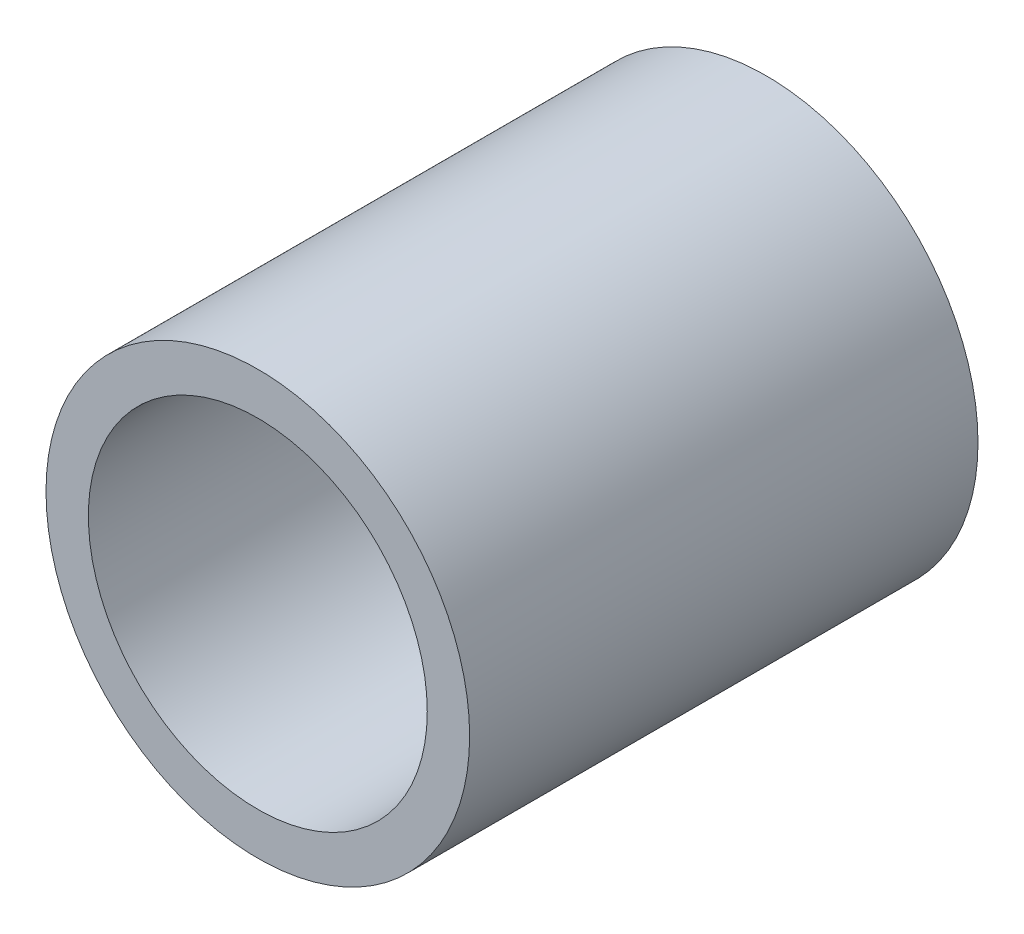
ISO-10303-21;
HEADER;
FILE_DESCRIPTION(('STEP AP214'),'2;1');
FILE_NAME('part.step','',(''),(''),'','','');
FILE_SCHEMA(('AUTOMOTIVE_DESIGN { 1 0 10303 214 1 1 1 1 }'));
ENDSEC;
DATA;
#1=APPLICATION_CONTEXT('core data for automotive mechanical design processes');
#2=APPLICATION_PROTOCOL_DEFINITION('international standard','automotive_design',2000,#1);
#3=PRODUCT_CONTEXT('',#1,'mechanical');
#4=PRODUCT('Part','Part','',(#3));
#5=PRODUCT_RELATED_PRODUCT_CATEGORY('part','',(#4));
#6=PRODUCT_DEFINITION_FORMATION('','',#4);
#7=PRODUCT_DEFINITION_CONTEXT('part definition',#1,'design');
#8=PRODUCT_DEFINITION('design','',#6,#7);
#9=PRODUCT_DEFINITION_SHAPE('','',#8);
#10=(LENGTH_UNIT() NAMED_UNIT(*) SI_UNIT(.MILLI.,.METRE.));
#11=(NAMED_UNIT(*) PLANE_ANGLE_UNIT() SI_UNIT($,.RADIAN.));
#12=(NAMED_UNIT(*) SI_UNIT($,.STERADIAN.) SOLID_ANGLE_UNIT());
#13=UNCERTAINTY_MEASURE_WITH_UNIT(LENGTH_MEASURE(1.E-05),#10,'distance_accuracy_value','');
#14=(GEOMETRIC_REPRESENTATION_CONTEXT(3) GLOBAL_UNCERTAINTY_ASSIGNED_CONTEXT((#13)) GLOBAL_UNIT_ASSIGNED_CONTEXT((#10,
#11,#12)) REPRESENTATION_CONTEXT('',''));
#15=CARTESIAN_POINT('',(0.,0.,0.));
#16=DIRECTION('',(0.,0.,1.));
#17=DIRECTION('',(1.,0.,0.));
#18=AXIS2_PLACEMENT_3D('',#15,#16,#17);
#19=CARTESIAN_POINT('',(0.,0.,6.));
#20=DIRECTION('',(0.,0.,-1.));
#21=DIRECTION('',(-1.,0.,0.));
#22=AXIS2_PLACEMENT_3D('',#19,#20,#21);
#23=CYLINDRICAL_SURFACE('',#22,2.5);
#24=CARTESIAN_POINT('',(0.,0.,6.));
#25=DIRECTION('',(0.,0.,1.));
#26=DIRECTION('',(1.,0.,0.));
#27=AXIS2_PLACEMENT_3D('',#24,#25,#26);
#28=CIRCLE('',#27,2.5);
#29=CARTESIAN_POINT('',(2.5,0.,6.));
#30=VERTEX_POINT('',#29);
#31=EDGE_CURVE('E10',#30,#30,#28,.T.);
#32=ORIENTED_EDGE('',*,*,#31,.F.);
#33=EDGE_LOOP('',(#32));
#34=FACE_BOUND('',#33,.T.);
#35=CARTESIAN_POINT('',(0.,0.,0.));
#36=DIRECTION('',(0.,0.,1.));
#37=DIRECTION('',(1.,0.,0.));
#38=AXIS2_PLACEMENT_3D('',#35,#36,#37);
#39=CIRCLE('',#38,2.5);
#40=CARTESIAN_POINT('',(2.5,0.,0.));
#41=VERTEX_POINT('',#40);
#42=EDGE_CURVE('E38',#41,#41,#39,.T.);
#43=ORIENTED_EDGE('',*,*,#42,.T.);
#44=EDGE_LOOP('',(#43));
#45=FACE_BOUND('',#44,.T.);
#46=ADVANCED_FACE('F35',(#34,#45),#23,.T.);
#47=CARTESIAN_POINT('',(0.,0.,6.));
#48=DIRECTION('',(0.,0.,1.));
#49=DIRECTION('',(1.,0.,0.));
#50=AXIS2_PLACEMENT_3D('',#47,#48,#49);
#51=PLANE('',#50);
#52=CARTESIAN_POINT('',(0.,0.,6.));
#53=DIRECTION('',(0.,0.,1.));
#54=DIRECTION('',(1.,0.,0.));
#55=AXIS2_PLACEMENT_3D('',#52,#53,#54);
#56=CIRCLE('',#55,2.);
#57=CARTESIAN_POINT('',(2.,0.,6.));
#58=VERTEX_POINT('',#57);
#59=EDGE_CURVE('E45',#58,#58,#56,.T.);
#60=ORIENTED_EDGE('',*,*,#59,.F.);
#61=EDGE_LOOP('',(#60));
#62=FACE_BOUND('',#61,.T.);
#63=ORIENTED_EDGE('',*,*,#31,.T.);
#64=EDGE_LOOP('',(#63));
#65=FACE_BOUND('',#64,.T.);
#66=ADVANCED_FACE('F65',(#62,#65),#51,.T.);
#67=CARTESIAN_POINT('',(0.,0.,0.));
#68=DIRECTION('',(0.,0.,1.));
#69=DIRECTION('',(1.,0.,0.));
#70=AXIS2_PLACEMENT_3D('',#67,#68,#69);
#71=PLANE('',#70);
#72=ORIENTED_EDGE('',*,*,#42,.F.);
#73=EDGE_LOOP('',(#72));
#74=FACE_BOUND('',#73,.T.);
#75=ADVANCED_FACE('F57',(#74),#71,.F.);
#76=CARTESIAN_POINT('',(0.,0.,6.));
#77=DIRECTION('',(0.,0.,-1.));
#78=DIRECTION('',(-1.,0.,0.));
#79=AXIS2_PLACEMENT_3D('',#76,#77,#78);
#80=CYLINDRICAL_SURFACE('',#79,2.);
#81=ORIENTED_EDGE('',*,*,#59,.T.);
#82=EDGE_LOOP('',(#81));
#83=FACE_BOUND('',#82,.T.);
#84=CARTESIAN_POINT('',(0.,0.,0.5));
#85=DIRECTION('',(0.,0.,1.));
#86=DIRECTION('',(1.,0.,0.));
#87=AXIS2_PLACEMENT_3D('',#84,#85,#86);
#88=CIRCLE('',#87,2.);
#89=CARTESIAN_POINT('',(2.,0.,0.5));
#90=VERTEX_POINT('',#89);
#91=EDGE_CURVE('E49',#90,#90,#88,.T.);
#92=ORIENTED_EDGE('',*,*,#91,.F.);
#93=EDGE_LOOP('',(#92));
#94=FACE_BOUND('',#93,.T.);
#95=ADVANCED_FACE('F55',(#83,#94),#80,.F.);
#96=CARTESIAN_POINT('',(0.,0.,0.5));
#97=DIRECTION('',(0.,0.,1.));
#98=DIRECTION('',(1.,0.,0.));
#99=AXIS2_PLACEMENT_3D('',#96,#97,#98);
#100=PLANE('',#99);
#101=ORIENTED_EDGE('',*,*,#91,.T.);
#102=EDGE_LOOP('',(#101));
#103=FACE_BOUND('',#102,.T.);
#104=ADVANCED_FACE('F53',(#103),#100,.T.);
#105=CLOSED_SHELL('',(#46,#66,#75,#95,#104));
#106=MANIFOLD_SOLID_BREP('B2',#105);
#107=ADVANCED_BREP_SHAPE_REPRESENTATION('',(#18,#106),#14);
#108=SHAPE_DEFINITION_REPRESENTATION(#9,#107);
ENDSEC;
END-ISO-10303-21;
